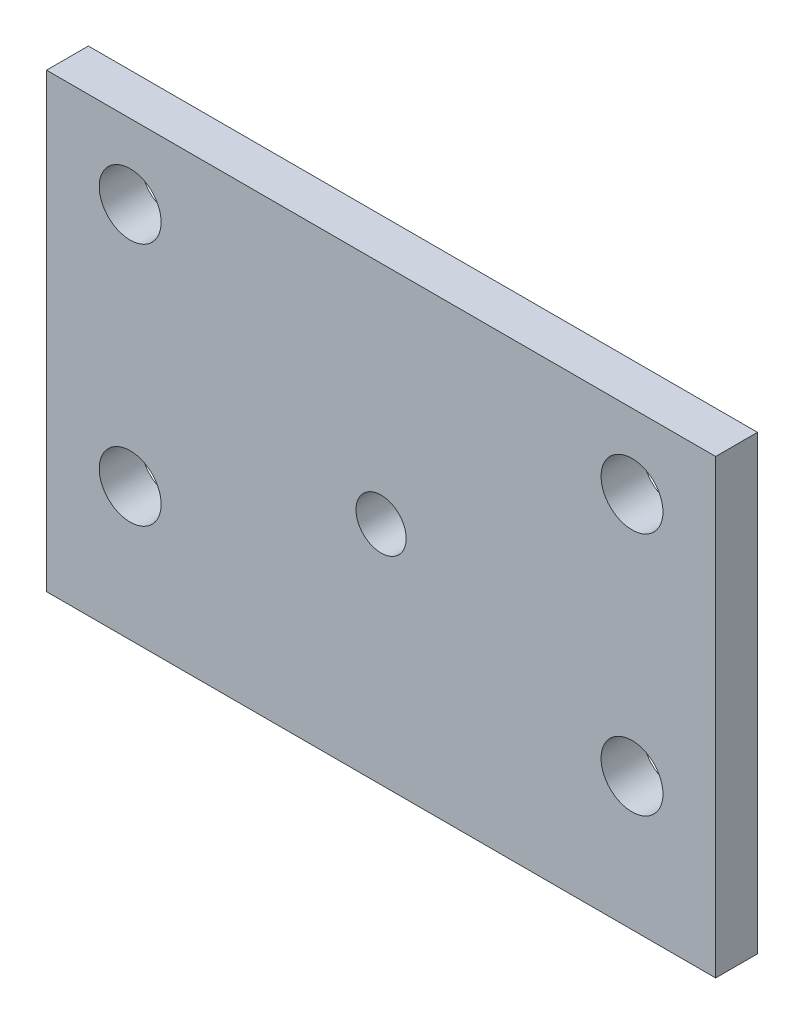
ISO-10303-21;
HEADER;
FILE_DESCRIPTION(('STEP AP214'),'2;1');
FILE_NAME('part.step','',(''),(''),'','','');
FILE_SCHEMA(('AUTOMOTIVE_DESIGN { 1 0 10303 214 1 1 1 1 }'));
ENDSEC;
DATA;
#1=APPLICATION_CONTEXT('core data for automotive mechanical design processes');
#2=APPLICATION_PROTOCOL_DEFINITION('international standard','automotive_design',2000,#1);
#3=PRODUCT_CONTEXT('',#1,'mechanical');
#4=PRODUCT('Part','Part','',(#3));
#5=PRODUCT_RELATED_PRODUCT_CATEGORY('part','',(#4));
#6=PRODUCT_DEFINITION_FORMATION('','',#4);
#7=PRODUCT_DEFINITION_CONTEXT('part definition',#1,'design');
#8=PRODUCT_DEFINITION('design','',#6,#7);
#9=PRODUCT_DEFINITION_SHAPE('','',#8);
#10=(LENGTH_UNIT() NAMED_UNIT(*) SI_UNIT(.MILLI.,.METRE.));
#11=(NAMED_UNIT(*) PLANE_ANGLE_UNIT() SI_UNIT($,.RADIAN.));
#12=(NAMED_UNIT(*) SI_UNIT($,.STERADIAN.) SOLID_ANGLE_UNIT());
#13=UNCERTAINTY_MEASURE_WITH_UNIT(LENGTH_MEASURE(1.E-05),#10,'distance_accuracy_value','');
#14=(GEOMETRIC_REPRESENTATION_CONTEXT(3) GLOBAL_UNCERTAINTY_ASSIGNED_CONTEXT((#13)) GLOBAL_UNIT_ASSIGNED_CONTEXT((#10,
#11,#12)) REPRESENTATION_CONTEXT('',''));
#15=CARTESIAN_POINT('',(0.,0.,0.));
#16=DIRECTION('',(0.,0.,1.));
#17=DIRECTION('',(1.,0.,0.));
#18=AXIS2_PLACEMENT_3D('',#15,#16,#17);
#19=CARTESIAN_POINT('',(0.,0.,3.175));
#20=DIRECTION('',(0.,0.,-1.));
#21=DIRECTION('',(-1.,0.,0.));
#22=AXIS2_PLACEMENT_3D('',#19,#20,#21);
#23=PLANE('',#22);
#24=DIRECTION('',(0.,1.,0.));
#25=VECTOR('',#24,1.);
#26=CARTESIAN_POINT('',(25.4,-17.145,3.175));
#27=LINE('',#26,#25);
#28=CARTESIAN_POINT('',(25.4,-17.145,3.175));
#29=VERTEX_POINT('',#28);
#30=CARTESIAN_POINT('',(25.4,17.145,3.175));
#31=VERTEX_POINT('',#30);
#32=EDGE_CURVE('E93',#29,#31,#27,.T.);
#33=ORIENTED_EDGE('',*,*,#32,.T.);
#34=DIRECTION('',(-1.,0.,0.));
#35=VECTOR('',#34,1.);
#36=CARTESIAN_POINT('',(-25.4,17.145,3.175));
#37=LINE('',#36,#35);
#38=CARTESIAN_POINT('',(-25.4,17.145,3.175));
#39=VERTEX_POINT('',#38);
#40=EDGE_CURVE('E88',#31,#39,#37,.T.);
#41=ORIENTED_EDGE('',*,*,#40,.T.);
#42=DIRECTION('',(0.,-1.,0.));
#43=VECTOR('',#42,1.);
#44=CARTESIAN_POINT('',(-25.4,-17.145,3.175));
#45=LINE('',#44,#43);
#46=CARTESIAN_POINT('',(-25.4,-17.145,3.175));
#47=VERTEX_POINT('',#46);
#48=EDGE_CURVE('E91',#39,#47,#45,.T.);
#49=ORIENTED_EDGE('',*,*,#48,.T.);
#50=DIRECTION('',(1.,0.,0.));
#51=VECTOR('',#50,1.);
#52=CARTESIAN_POINT('',(-25.4,-17.145,3.175));
#53=LINE('',#52,#51);
#54=EDGE_CURVE('E58',#47,#29,#53,.T.);
#55=ORIENTED_EDGE('',*,*,#54,.T.);
#56=EDGE_LOOP('',(#33,#41,#49,#55));
#57=FACE_BOUND('',#56,.T.);
#58=CARTESIAN_POINT('',(19.05,-7.0485,3.175));
#59=DIRECTION('',(0.,0.,1.));
#60=DIRECTION('',(1.,0.,0.));
#61=AXIS2_PLACEMENT_3D('',#58,#59,#60);
#62=CIRCLE('',#61,2.3495);
#63=CARTESIAN_POINT('',(21.3995,-7.0485,3.175));
#64=VERTEX_POINT('',#63);
#65=EDGE_CURVE('E108',#64,#64,#62,.T.);
#66=ORIENTED_EDGE('',*,*,#65,.F.);
#67=EDGE_LOOP('',(#66));
#68=FACE_BOUND('',#67,.T.);
#69=CARTESIAN_POINT('',(19.05,11.4935,3.175));
#70=DIRECTION('',(0.,0.,1.));
#71=DIRECTION('',(1.,0.,0.));
#72=AXIS2_PLACEMENT_3D('',#69,#70,#71);
#73=CIRCLE('',#72,2.3495);
#74=CARTESIAN_POINT('',(21.3995,11.4935,3.175));
#75=VERTEX_POINT('',#74);
#76=EDGE_CURVE('E123',#75,#75,#73,.T.);
#77=ORIENTED_EDGE('',*,*,#76,.F.);
#78=EDGE_LOOP('',(#77));
#79=FACE_BOUND('',#78,.T.);
#80=CARTESIAN_POINT('',(-19.05,11.4935,3.175));
#81=DIRECTION('',(0.,0.,1.));
#82=DIRECTION('',(1.,0.,0.));
#83=AXIS2_PLACEMENT_3D('',#80,#81,#82);
#84=CIRCLE('',#83,2.3495);
#85=CARTESIAN_POINT('',(-16.7005,11.4935,3.175));
#86=VERTEX_POINT('',#85);
#87=EDGE_CURVE('E129',#86,#86,#84,.T.);
#88=ORIENTED_EDGE('',*,*,#87,.F.);
#89=EDGE_LOOP('',(#88));
#90=FACE_BOUND('',#89,.T.);
#91=CARTESIAN_POINT('',(-19.05,-7.0485,3.175));
#92=DIRECTION('',(0.,0.,1.));
#93=DIRECTION('',(1.,0.,0.));
#94=AXIS2_PLACEMENT_3D('',#91,#92,#93);
#95=CIRCLE('',#94,2.3495);
#96=CARTESIAN_POINT('',(-16.7005,-7.0485,3.175));
#97=VERTEX_POINT('',#96);
#98=EDGE_CURVE('E135',#97,#97,#95,.T.);
#99=ORIENTED_EDGE('',*,*,#98,.F.);
#100=EDGE_LOOP('',(#99));
#101=FACE_BOUND('',#100,.T.);
#102=CARTESIAN_POINT('',(0.,0.,3.175));
#103=DIRECTION('',(0.,0.,1.));
#104=DIRECTION('',(1.,0.,0.));
#105=AXIS2_PLACEMENT_3D('',#102,#103,#104);
#106=CIRCLE('',#105,1.905);
#107=CARTESIAN_POINT('',(1.90500000000003,0.,3.175));
#108=VERTEX_POINT('',#107);
#109=EDGE_CURVE('E141',#108,#108,#106,.T.);
#110=ORIENTED_EDGE('',*,*,#109,.F.);
#111=EDGE_LOOP('',(#110));
#112=FACE_BOUND('',#111,.T.);
#113=ADVANCED_FACE('F41',(#57,#68,#79,#90,#101,#112),#23,.F.);
#114=CARTESIAN_POINT('',(0.,0.,0.));
#115=DIRECTION('',(0.,0.,-1.));
#116=DIRECTION('',(-1.,0.,0.));
#117=AXIS2_PLACEMENT_3D('',#114,#115,#116);
#118=PLANE('',#117);
#119=CARTESIAN_POINT('',(-19.05,-7.0485,0.));
#120=DIRECTION('',(0.,0.,1.));
#121=DIRECTION('',(1.,0.,0.));
#122=AXIS2_PLACEMENT_3D('',#119,#120,#121);
#123=CIRCLE('',#122,2.3495);
#124=CARTESIAN_POINT('',(-16.7005,-7.0485,0.));
#125=VERTEX_POINT('',#124);
#126=EDGE_CURVE('E138',#125,#125,#123,.T.);
#127=ORIENTED_EDGE('',*,*,#126,.T.);
#128=EDGE_LOOP('',(#127));
#129=FACE_BOUND('',#128,.T.);
#130=CARTESIAN_POINT('',(19.05,11.4935,0.));
#131=DIRECTION('',(0.,0.,1.));
#132=DIRECTION('',(1.,0.,0.));
#133=AXIS2_PLACEMENT_3D('',#130,#131,#132);
#134=CIRCLE('',#133,2.3495);
#135=CARTESIAN_POINT('',(21.3995,11.4935,0.));
#136=VERTEX_POINT('',#135);
#137=EDGE_CURVE('E126',#136,#136,#134,.T.);
#138=ORIENTED_EDGE('',*,*,#137,.T.);
#139=EDGE_LOOP('',(#138));
#140=FACE_BOUND('',#139,.T.);
#141=DIRECTION('',(0.,1.,0.));
#142=VECTOR('',#141,1.);
#143=CARTESIAN_POINT('',(25.4,-17.145,0.));
#144=LINE('',#143,#142);
#145=CARTESIAN_POINT('',(25.4,-17.145,0.));
#146=VERTEX_POINT('',#145);
#147=CARTESIAN_POINT('',(25.4,17.145,0.));
#148=VERTEX_POINT('',#147);
#149=EDGE_CURVE('E105',#146,#148,#144,.T.);
#150=ORIENTED_EDGE('',*,*,#149,.F.);
#151=DIRECTION('',(1.,0.,0.));
#152=VECTOR('',#151,1.);
#153=CARTESIAN_POINT('',(-25.4,-17.145,0.));
#154=LINE('',#153,#152);
#155=CARTESIAN_POINT('',(-25.4,-17.145,0.));
#156=VERTEX_POINT('',#155);
#157=EDGE_CURVE('E81',#156,#146,#154,.T.);
#158=ORIENTED_EDGE('',*,*,#157,.F.);
#159=DIRECTION('',(0.,-1.,0.));
#160=VECTOR('',#159,1.);
#161=CARTESIAN_POINT('',(-25.4,-17.145,0.));
#162=LINE('',#161,#160);
#163=CARTESIAN_POINT('',(-25.4,17.145,0.));
#164=VERTEX_POINT('',#163);
#165=EDGE_CURVE('E75',#164,#156,#162,.T.);
#166=ORIENTED_EDGE('',*,*,#165,.F.);
#167=DIRECTION('',(-1.,0.,0.));
#168=VECTOR('',#167,1.);
#169=CARTESIAN_POINT('',(-25.4,17.145,0.));
#170=LINE('',#169,#168);
#171=EDGE_CURVE('E97',#148,#164,#170,.T.);
#172=ORIENTED_EDGE('',*,*,#171,.F.);
#173=EDGE_LOOP('',(#150,#158,#166,#172));
#174=FACE_BOUND('',#173,.T.);
#175=CARTESIAN_POINT('',(19.05,-7.0485,0.));
#176=DIRECTION('',(0.,0.,1.));
#177=DIRECTION('',(1.,0.,0.));
#178=AXIS2_PLACEMENT_3D('',#175,#176,#177);
#179=CIRCLE('',#178,2.3495);
#180=CARTESIAN_POINT('',(21.3995,-7.0485,0.));
#181=VERTEX_POINT('',#180);
#182=EDGE_CURVE('E120',#181,#181,#179,.T.);
#183=ORIENTED_EDGE('',*,*,#182,.T.);
#184=EDGE_LOOP('',(#183));
#185=FACE_BOUND('',#184,.T.);
#186=CARTESIAN_POINT('',(-19.05,11.4935,0.));
#187=DIRECTION('',(0.,0.,1.));
#188=DIRECTION('',(1.,0.,0.));
#189=AXIS2_PLACEMENT_3D('',#186,#187,#188);
#190=CIRCLE('',#189,2.3495);
#191=CARTESIAN_POINT('',(-16.7005,11.4935,0.));
#192=VERTEX_POINT('',#191);
#193=EDGE_CURVE('E132',#192,#192,#190,.T.);
#194=ORIENTED_EDGE('',*,*,#193,.T.);
#195=EDGE_LOOP('',(#194));
#196=FACE_BOUND('',#195,.T.);
#197=CARTESIAN_POINT('',(0.,0.,0.));
#198=DIRECTION('',(0.,0.,1.));
#199=DIRECTION('',(1.,0.,0.));
#200=AXIS2_PLACEMENT_3D('',#197,#198,#199);
#201=CIRCLE('',#200,1.905);
#202=CARTESIAN_POINT('',(1.90500000000003,0.,0.));
#203=VERTEX_POINT('',#202);
#204=EDGE_CURVE('E144',#203,#203,#201,.T.);
#205=ORIENTED_EDGE('',*,*,#204,.T.);
#206=EDGE_LOOP('',(#205));
#207=FACE_BOUND('',#206,.T.);
#208=ADVANCED_FACE('F116',(#129,#140,#174,#185,#196,#207),#118,.T.);
#209=CARTESIAN_POINT('',(25.4,-17.145,3.175));
#210=DIRECTION('',(-1.,0.,0.));
#211=DIRECTION('',(0.,0.,1.));
#212=AXIS2_PLACEMENT_3D('',#209,#210,#211);
#213=PLANE('',#212);
#214=ORIENTED_EDGE('',*,*,#149,.T.);
#215=DIRECTION('',(0.,0.,-1.));
#216=VECTOR('',#215,1.);
#217=CARTESIAN_POINT('',(25.4,17.145,3.175));
#218=LINE('',#217,#216);
#219=EDGE_CURVE('E11',#31,#148,#218,.T.);
#220=ORIENTED_EDGE('',*,*,#219,.F.);
#221=ORIENTED_EDGE('',*,*,#32,.F.);
#222=DIRECTION('',(0.,0.,-1.));
#223=VECTOR('',#222,1.);
#224=CARTESIAN_POINT('',(25.4,-17.145,3.175));
#225=LINE('',#224,#223);
#226=EDGE_CURVE('E101',#29,#146,#225,.T.);
#227=ORIENTED_EDGE('',*,*,#226,.T.);
#228=EDGE_LOOP('',(#214,#220,#221,#227));
#229=FACE_BOUND('',#228,.T.);
#230=ADVANCED_FACE('F43',(#229),#213,.F.);
#231=CARTESIAN_POINT('',(-25.4,17.145,3.175));
#232=DIRECTION('',(0.,-1.,0.));
#233=DIRECTION('',(0.,0.,-1.));
#234=AXIS2_PLACEMENT_3D('',#231,#232,#233);
#235=PLANE('',#234);
#236=ORIENTED_EDGE('',*,*,#171,.T.);
#237=DIRECTION('',(0.,0.,-1.));
#238=VECTOR('',#237,1.);
#239=CARTESIAN_POINT('',(-25.4,17.145,3.175));
#240=LINE('',#239,#238);
#241=EDGE_CURVE('E50',#39,#164,#240,.T.);
#242=ORIENTED_EDGE('',*,*,#241,.F.);
#243=ORIENTED_EDGE('',*,*,#40,.F.);
#244=ORIENTED_EDGE('',*,*,#219,.T.);
#245=EDGE_LOOP('',(#236,#242,#243,#244));
#246=FACE_BOUND('',#245,.T.);
#247=ADVANCED_FACE('F96',(#246),#235,.F.);
#248=CARTESIAN_POINT('',(-25.4,-17.145,3.175));
#249=DIRECTION('',(1.,0.,0.));
#250=DIRECTION('',(0.,0.,-1.));
#251=AXIS2_PLACEMENT_3D('',#248,#249,#250);
#252=PLANE('',#251);
#253=ORIENTED_EDGE('',*,*,#165,.T.);
#254=DIRECTION('',(0.,0.,-1.));
#255=VECTOR('',#254,1.);
#256=CARTESIAN_POINT('',(-25.4,-17.145,3.175));
#257=LINE('',#256,#255);
#258=EDGE_CURVE('E98',#47,#156,#257,.T.);
#259=ORIENTED_EDGE('',*,*,#258,.F.);
#260=ORIENTED_EDGE('',*,*,#48,.F.);
#261=ORIENTED_EDGE('',*,*,#241,.T.);
#262=EDGE_LOOP('',(#253,#259,#260,#261));
#263=FACE_BOUND('',#262,.T.);
#264=ADVANCED_FACE('F99',(#263),#252,.F.);
#265=CARTESIAN_POINT('',(-25.4,-17.145,3.175));
#266=DIRECTION('',(0.,1.,0.));
#267=DIRECTION('',(0.,0.,1.));
#268=AXIS2_PLACEMENT_3D('',#265,#266,#267);
#269=PLANE('',#268);
#270=ORIENTED_EDGE('',*,*,#157,.T.);
#271=ORIENTED_EDGE('',*,*,#226,.F.);
#272=ORIENTED_EDGE('',*,*,#54,.F.);
#273=ORIENTED_EDGE('',*,*,#258,.T.);
#274=EDGE_LOOP('',(#270,#271,#272,#273));
#275=FACE_BOUND('',#274,.T.);
#276=ADVANCED_FACE('F113',(#275),#269,.F.);
#277=CARTESIAN_POINT('',(19.05,-7.0485,3.175));
#278=DIRECTION('',(0.,0.,-1.));
#279=DIRECTION('',(-1.,0.,0.));
#280=AXIS2_PLACEMENT_3D('',#277,#278,#279);
#281=CYLINDRICAL_SURFACE('',#280,2.3495);
#282=ORIENTED_EDGE('',*,*,#65,.T.);
#283=EDGE_LOOP('',(#282));
#284=FACE_BOUND('',#283,.T.);
#285=ORIENTED_EDGE('',*,*,#182,.F.);
#286=EDGE_LOOP('',(#285));
#287=FACE_BOUND('',#286,.T.);
#288=ADVANCED_FACE('F161',(#284,#287),#281,.F.);
#289=CARTESIAN_POINT('',(19.05,11.4935,3.175));
#290=DIRECTION('',(0.,0.,-1.));
#291=DIRECTION('',(-1.,0.,0.));
#292=AXIS2_PLACEMENT_3D('',#289,#290,#291);
#293=CYLINDRICAL_SURFACE('',#292,2.3495);
#294=ORIENTED_EDGE('',*,*,#76,.T.);
#295=EDGE_LOOP('',(#294));
#296=FACE_BOUND('',#295,.T.);
#297=ORIENTED_EDGE('',*,*,#137,.F.);
#298=EDGE_LOOP('',(#297));
#299=FACE_BOUND('',#298,.T.);
#300=ADVANCED_FACE('F206',(#296,#299),#293,.F.);
#301=CARTESIAN_POINT('',(-19.05,11.4935,3.175));
#302=DIRECTION('',(0.,0.,-1.));
#303=DIRECTION('',(-1.,0.,0.));
#304=AXIS2_PLACEMENT_3D('',#301,#302,#303);
#305=CYLINDRICAL_SURFACE('',#304,2.3495);
#306=ORIENTED_EDGE('',*,*,#87,.T.);
#307=EDGE_LOOP('',(#306));
#308=FACE_BOUND('',#307,.T.);
#309=ORIENTED_EDGE('',*,*,#193,.F.);
#310=EDGE_LOOP('',(#309));
#311=FACE_BOUND('',#310,.T.);
#312=ADVANCED_FACE('F214',(#308,#311),#305,.F.);
#313=CARTESIAN_POINT('',(-19.05,-7.0485,3.175));
#314=DIRECTION('',(0.,0.,-1.));
#315=DIRECTION('',(-1.,0.,0.));
#316=AXIS2_PLACEMENT_3D('',#313,#314,#315);
#317=CYLINDRICAL_SURFACE('',#316,2.3495);
#318=ORIENTED_EDGE('',*,*,#98,.T.);
#319=EDGE_LOOP('',(#318));
#320=FACE_BOUND('',#319,.T.);
#321=ORIENTED_EDGE('',*,*,#126,.F.);
#322=EDGE_LOOP('',(#321));
#323=FACE_BOUND('',#322,.T.);
#324=ADVANCED_FACE('F222',(#320,#323),#317,.F.);
#325=CARTESIAN_POINT('',(0.,0.,3.175));
#326=DIRECTION('',(0.,0.,-1.));
#327=DIRECTION('',(-1.,0.,0.));
#328=AXIS2_PLACEMENT_3D('',#325,#326,#327);
#329=CYLINDRICAL_SURFACE('',#328,1.905);
#330=ORIENTED_EDGE('',*,*,#109,.T.);
#331=EDGE_LOOP('',(#330));
#332=FACE_BOUND('',#331,.T.);
#333=ORIENTED_EDGE('',*,*,#204,.F.);
#334=EDGE_LOOP('',(#333));
#335=FACE_BOUND('',#334,.T.);
#336=ADVANCED_FACE('F150',(#332,#335),#329,.F.);
#337=CLOSED_SHELL('',(#113,#208,#230,#247,#264,#276,#288,#300,#312,#324,#336));
#338=MANIFOLD_SOLID_BREP('B2',#337);
#339=ADVANCED_BREP_SHAPE_REPRESENTATION('',(#18,#338),#14);
#340=SHAPE_DEFINITION_REPRESENTATION(#9,#339);
ENDSEC;
END-ISO-10303-21;
